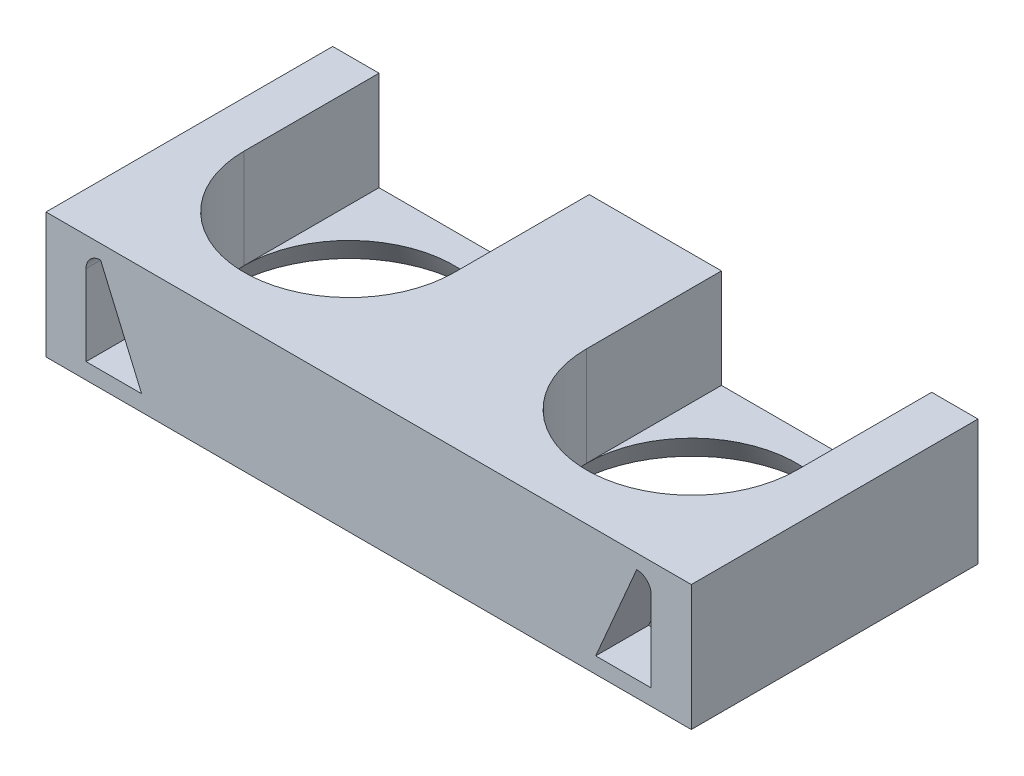
ISO-10303-21;
HEADER;
FILE_DESCRIPTION(('STEP AP214'),'2;1');
FILE_NAME('part.step','',(''),(''),'','','');
FILE_SCHEMA(('AUTOMOTIVE_DESIGN { 1 0 10303 214 1 1 1 1 }'));
ENDSEC;
DATA;
#1=APPLICATION_CONTEXT('core data for automotive mechanical design processes');
#2=APPLICATION_PROTOCOL_DEFINITION('international standard','automotive_design',2000,#1);
#3=PRODUCT_CONTEXT('',#1,'mechanical');
#4=PRODUCT('Part','Part','',(#3));
#5=PRODUCT_RELATED_PRODUCT_CATEGORY('part','',(#4));
#6=PRODUCT_DEFINITION_FORMATION('','',#4);
#7=PRODUCT_DEFINITION_CONTEXT('part definition',#1,'design');
#8=PRODUCT_DEFINITION('design','',#6,#7);
#9=PRODUCT_DEFINITION_SHAPE('','',#8);
#10=(LENGTH_UNIT() NAMED_UNIT(*) SI_UNIT(.MILLI.,.METRE.));
#11=(NAMED_UNIT(*) PLANE_ANGLE_UNIT() SI_UNIT($,.RADIAN.));
#12=(NAMED_UNIT(*) SI_UNIT($,.STERADIAN.) SOLID_ANGLE_UNIT());
#13=UNCERTAINTY_MEASURE_WITH_UNIT(LENGTH_MEASURE(1.E-05),#10,'distance_accuracy_value','');
#14=(GEOMETRIC_REPRESENTATION_CONTEXT(3) GLOBAL_UNCERTAINTY_ASSIGNED_CONTEXT((#13)) GLOBAL_UNIT_ASSIGNED_CONTEXT((#10,
#11,#12)) REPRESENTATION_CONTEXT('',''));
#15=CARTESIAN_POINT('',(0.,0.,0.));
#16=DIRECTION('',(0.,0.,1.));
#17=DIRECTION('',(1.,0.,0.));
#18=AXIS2_PLACEMENT_3D('',#15,#16,#17);
#19=CARTESIAN_POINT('',(24.404047634165,-12.4,1.28478141343808));
#20=DIRECTION('',(0.,0.,-1.));
#21=DIRECTION('',(-1.,0.,0.));
#22=AXIS2_PLACEMENT_3D('',#19,#20,#21);
#23=PLANE('',#22);
#24=DIRECTION('',(-0.39545835021334,0.918483910172924,0.));
#25=VECTOR('',#24,1.);
#26=CARTESIAN_POINT('',(-19.2778693688237,-8.3001937560213,1.28478141343808));
#27=LINE('',#26,#25);
#28=CARTESIAN_POINT('',(-17.1732064728308,-13.1884430628437,1.28478141343808));
#29=VERTEX_POINT('',#28);
#30=CARTESIAN_POINT('',(-20.2732064728308,-5.98844306284365,1.28478141343808));
#31=VERTEX_POINT('',#30);
#32=EDGE_CURVE('E209',#29,#31,#27,.T.);
#33=ORIENTED_EDGE('',*,*,#32,.F.);
#34=DIRECTION('',(1.,0.,0.));
#35=VECTOR('',#34,1.);
#36=CARTESIAN_POINT('',(0.,-13.1884430628437,1.28478141343808));
#37=LINE('',#36,#35);
#38=CARTESIAN_POINT('',(-21.3732064728308,-13.1884430628437,1.28478141343808));
#39=VERTEX_POINT('',#38);
#40=EDGE_CURVE('E78',#39,#29,#37,.T.);
#41=ORIENTED_EDGE('',*,*,#40,.F.);
#42=DIRECTION('',(0.,-1.,0.));
#43=VECTOR('',#42,1.);
#44=CARTESIAN_POINT('',(-21.3732064728308,0.,1.28478141343808));
#45=LINE('',#44,#43);
#46=CARTESIAN_POINT('',(-21.3732064728308,-7.08844306284365,1.28478141343808));
#47=VERTEX_POINT('',#46);
#48=EDGE_CURVE('E227',#47,#39,#45,.T.);
#49=ORIENTED_EDGE('',*,*,#48,.F.);
#50=CARTESIAN_POINT('',(-20.2732064728308,-7.08844306284365,1.28478141343808));
#51=DIRECTION('',(0.,0.,1.));
#52=DIRECTION('',(1.,0.,0.));
#53=AXIS2_PLACEMENT_3D('',#50,#51,#52);
#54=CIRCLE('',#53,1.1);
#55=EDGE_CURVE('E233',#31,#47,#54,.T.);
#56=ORIENTED_EDGE('',*,*,#55,.F.);
#57=EDGE_LOOP('',(#33,#41,#49,#56));
#58=FACE_BOUND('',#57,.T.);
#59=DIRECTION('',(-1.,0.,0.));
#60=VECTOR('',#59,1.);
#61=CARTESIAN_POINT('',(24.404047634165,-4.9,1.28478141343808));
#62=LINE('',#61,#60);
#63=CARTESIAN_POINT('',(24.404047634165,-4.9,1.28478141343808));
#64=VERTEX_POINT('',#63);
#65=CARTESIAN_POINT('',(-24.404047634165,-4.9,1.28478141343808));
#66=VERTEX_POINT('',#65);
#67=EDGE_CURVE('E318',#64,#66,#62,.T.);
#68=ORIENTED_EDGE('',*,*,#67,.T.);
#69=DIRECTION('',(0.,1.,0.));
#70=VECTOR('',#69,1.);
#71=CARTESIAN_POINT('',(-24.404047634165,-12.4,1.28478141343808));
#72=LINE('',#71,#70);
#73=CARTESIAN_POINT('',(-24.404047634165,-14.4,1.28478141343808));
#74=VERTEX_POINT('',#73);
#75=EDGE_CURVE('E353',#74,#66,#72,.T.);
#76=ORIENTED_EDGE('',*,*,#75,.F.);
#77=DIRECTION('',(-1.,0.,0.));
#78=VECTOR('',#77,1.);
#79=CARTESIAN_POINT('',(24.404047634165,-14.4,1.28478141343808));
#80=LINE('',#79,#78);
#81=CARTESIAN_POINT('',(24.404047634165,-14.4,1.28478141343808));
#82=VERTEX_POINT('',#81);
#83=EDGE_CURVE('E278',#82,#74,#80,.T.);
#84=ORIENTED_EDGE('',*,*,#83,.F.);
#85=DIRECTION('',(0.,1.,0.));
#86=VECTOR('',#85,1.);
#87=CARTESIAN_POINT('',(24.404047634165,-12.4,1.28478141343808));
#88=LINE('',#87,#86);
#89=EDGE_CURVE('E356',#82,#64,#88,.T.);
#90=ORIENTED_EDGE('',*,*,#89,.T.);
#91=EDGE_LOOP('',(#68,#76,#84,#90));
#92=FACE_BOUND('',#91,.T.);
#93=CARTESIAN_POINT('',(20.2732064728308,-7.08844306284365,1.28478141343808));
#94=DIRECTION('',(0.,0.,1.));
#95=DIRECTION('',(1.,0.,0.));
#96=AXIS2_PLACEMENT_3D('',#93,#94,#95);
#97=CIRCLE('',#96,1.1);
#98=CARTESIAN_POINT('',(20.2732064728308,-5.98844306284365,1.28478141343808));
#99=VERTEX_POINT('',#98);
#100=CARTESIAN_POINT('',(21.3732064728308,-7.08844306284365,1.28478141343808));
#101=VERTEX_POINT('',#100);
#102=EDGE_CURVE('E86',#99,#101,#97,.F.);
#103=ORIENTED_EDGE('',*,*,#102,.T.);
#104=DIRECTION('',(0.,-1.,0.));
#105=VECTOR('',#104,1.);
#106=CARTESIAN_POINT('',(21.3732064728308,0.,1.28478141343808));
#107=LINE('',#106,#105);
#108=CARTESIAN_POINT('',(21.3732064728308,-13.1884430628437,1.28478141343808));
#109=VERTEX_POINT('',#108);
#110=EDGE_CURVE('E252',#101,#109,#107,.T.);
#111=ORIENTED_EDGE('',*,*,#110,.T.);
#112=DIRECTION('',(-1.,0.,0.));
#113=VECTOR('',#112,1.);
#114=CARTESIAN_POINT('',(0.,-13.1884430628437,1.28478141343808));
#115=LINE('',#114,#113);
#116=CARTESIAN_POINT('',(17.1732064728308,-13.1884430628437,1.28478141343808));
#117=VERTEX_POINT('',#116);
#118=EDGE_CURVE('E255',#109,#117,#115,.T.);
#119=ORIENTED_EDGE('',*,*,#118,.T.);
#120=DIRECTION('',(0.39545835021334,0.918483910172924,0.));
#121=VECTOR('',#120,1.);
#122=CARTESIAN_POINT('',(19.2778693688238,-8.30019375602131,1.28478141343808));
#123=LINE('',#122,#121);
#124=EDGE_CURVE('E259',#117,#99,#123,.T.);
#125=ORIENTED_EDGE('',*,*,#124,.T.);
#126=EDGE_LOOP('',(#103,#111,#119,#125));
#127=FACE_BOUND('',#126,.T.);
#128=ADVANCED_FACE('F62',(#58,#92,#127),#23,.F.);
#129=CARTESIAN_POINT('',(0.,-12.4,0.));
#130=DIRECTION('',(0.,1.,0.));
#131=DIRECTION('',(0.,0.,1.));
#132=AXIS2_PLACEMENT_3D('',#129,#130,#131);
#133=PLANE('',#132);
#134=DIRECTION('',(0.,0.,1.));
#135=VECTOR('',#134,1.);
#136=CARTESIAN_POINT('',(-20.9,-12.4,-10.2));
#137=LINE('',#136,#135);
#138=CARTESIAN_POINT('',(-20.9,-12.4,-20.4));
#139=VERTEX_POINT('',#138);
#140=CARTESIAN_POINT('',(-20.9,-12.4,-10.2));
#141=VERTEX_POINT('',#140);
#142=EDGE_CURVE('E298',#139,#141,#137,.T.);
#143=ORIENTED_EDGE('',*,*,#142,.T.);
#144=CARTESIAN_POINT('',(-12.95,-12.4,-10.2));
#145=DIRECTION('',(0.,-1.,0.));
#146=DIRECTION('',(0.,0.,-1.));
#147=AXIS2_PLACEMENT_3D('',#144,#145,#146);
#148=CIRCLE('',#147,7.94999999999999);
#149=CARTESIAN_POINT('',(-5.,-12.4,-10.2));
#150=VERTEX_POINT('',#149);
#151=EDGE_CURVE('E239',#141,#150,#148,.T.);
#152=ORIENTED_EDGE('',*,*,#151,.T.);
#153=DIRECTION('',(0.,0.,-1.));
#154=VECTOR('',#153,1.);
#155=CARTESIAN_POINT('',(-5.,-12.4,-10.2));
#156=LINE('',#155,#154);
#157=CARTESIAN_POINT('',(-5.,-12.4,-20.4));
#158=VERTEX_POINT('',#157);
#159=EDGE_CURVE('E303',#150,#158,#156,.T.);
#160=ORIENTED_EDGE('',*,*,#159,.T.);
#161=DIRECTION('',(1.,0.,0.));
#162=VECTOR('',#161,1.);
#163=CARTESIAN_POINT('',(24.404047634165,-12.4,-20.4));
#164=LINE('',#163,#162);
#165=EDGE_CURVE('E279',#139,#158,#164,.T.);
#166=ORIENTED_EDGE('',*,*,#165,.F.);
#167=EDGE_LOOP('',(#143,#152,#160,#166));
#168=FACE_BOUND('',#167,.T.);
#169=ADVANCED_FACE('F409',(#168),#133,.T.);
#170=DIRECTION('',(0.,0.,1.));
#171=VECTOR('',#170,1.);
#172=CARTESIAN_POINT('',(5.00000000000001,-12.4,-10.2));
#173=LINE('',#172,#171);
#174=CARTESIAN_POINT('',(5.00000000000001,-12.4,-20.4));
#175=VERTEX_POINT('',#174);
#176=CARTESIAN_POINT('',(5.00000000000001,-12.4,-10.2));
#177=VERTEX_POINT('',#176);
#178=EDGE_CURVE('E306',#175,#177,#173,.T.);
#179=ORIENTED_EDGE('',*,*,#178,.T.);
#180=CARTESIAN_POINT('',(12.95,-12.4,-10.2));
#181=DIRECTION('',(0.,1.,0.));
#182=DIRECTION('',(0.,0.,1.));
#183=AXIS2_PLACEMENT_3D('',#180,#181,#182);
#184=CIRCLE('',#183,7.95);
#185=CARTESIAN_POINT('',(20.9,-12.4,-10.2));
#186=VERTEX_POINT('',#185);
#187=EDGE_CURVE('E12',#177,#186,#184,.F.);
#188=ORIENTED_EDGE('',*,*,#187,.T.);
#189=DIRECTION('',(0.,0.,-1.));
#190=VECTOR('',#189,1.);
#191=CARTESIAN_POINT('',(20.9,-12.4,-10.2));
#192=LINE('',#191,#190);
#193=CARTESIAN_POINT('',(20.9,-12.4,-20.4));
#194=VERTEX_POINT('',#193);
#195=EDGE_CURVE('E294',#186,#194,#192,.T.);
#196=ORIENTED_EDGE('',*,*,#195,.T.);
#197=EDGE_CURVE('E289',#175,#194,#164,.T.);
#198=ORIENTED_EDGE('',*,*,#197,.F.);
#199=EDGE_LOOP('',(#179,#188,#196,#198));
#200=FACE_BOUND('',#199,.T.);
#201=ADVANCED_FACE('F428',(#200),#133,.T.);
#202=CARTESIAN_POINT('',(12.95,-12.4,-10.2));
#203=DIRECTION('',(0.,1.,0.));
#204=DIRECTION('',(0.,0.,1.));
#205=AXIS2_PLACEMENT_3D('',#202,#203,#204);
#206=CYLINDRICAL_SURFACE('',#205,7.95);
#207=CARTESIAN_POINT('',(12.95,-4.9,-10.2));
#208=DIRECTION('',(0.,1.,0.));
#209=DIRECTION('',(0.,0.,-1.));
#210=AXIS2_PLACEMENT_3D('',#207,#208,#209);
#211=CIRCLE('',#210,7.95);
#212=CARTESIAN_POINT('',(5.00000000000001,-4.9,-10.2));
#213=VERTEX_POINT('',#212);
#214=CARTESIAN_POINT('',(20.9,-4.9,-10.2));
#215=VERTEX_POINT('',#214);
#216=EDGE_CURVE('E288',#213,#215,#211,.T.);
#217=ORIENTED_EDGE('',*,*,#216,.T.);
#218=DIRECTION('',(0.,1.,0.));
#219=VECTOR('',#218,1.);
#220=CARTESIAN_POINT('',(20.9,-12.4,-10.2));
#221=LINE('',#220,#219);
#222=EDGE_CURVE('E71',#186,#215,#221,.T.);
#223=ORIENTED_EDGE('',*,*,#222,.F.);
#224=CARTESIAN_POINT('',(12.95,-12.4,-10.2));
#225=DIRECTION('',(0.,1.,0.));
#226=DIRECTION('',(0.,0.,-1.));
#227=AXIS2_PLACEMENT_3D('',#224,#225,#226);
#228=CIRCLE('',#227,7.95);
#229=EDGE_CURVE('E292',#177,#186,#228,.T.);
#230=ORIENTED_EDGE('',*,*,#229,.F.);
#231=DIRECTION('',(0.,1.,0.));
#232=VECTOR('',#231,1.);
#233=CARTESIAN_POINT('',(5.00000000000001,-12.4,-10.2));
#234=LINE('',#233,#232);
#235=EDGE_CURVE('E309',#177,#213,#234,.T.);
#236=ORIENTED_EDGE('',*,*,#235,.T.);
#237=EDGE_LOOP('',(#217,#223,#230,#236));
#238=FACE_BOUND('',#237,.T.);
#239=ADVANCED_FACE('F64',(#238),#206,.F.);
#240=CARTESIAN_POINT('',(20.9,-12.4,-10.2));
#241=DIRECTION('',(1.,0.,0.));
#242=DIRECTION('',(0.,0.,-1.));
#243=AXIS2_PLACEMENT_3D('',#240,#241,#242);
#244=PLANE('',#243);
#245=DIRECTION('',(0.,0.,-1.));
#246=VECTOR('',#245,1.);
#247=CARTESIAN_POINT('',(20.9,-4.9,-10.2));
#248=LINE('',#247,#246);
#249=CARTESIAN_POINT('',(20.9,-4.9,-20.4));
#250=VERTEX_POINT('',#249);
#251=EDGE_CURVE('E312',#215,#250,#248,.T.);
#252=ORIENTED_EDGE('',*,*,#251,.T.);
#253=DIRECTION('',(0.,1.,0.));
#254=VECTOR('',#253,1.);
#255=CARTESIAN_POINT('',(20.9,-12.4,-20.4));
#256=LINE('',#255,#254);
#257=EDGE_CURVE('E362',#194,#250,#256,.T.);
#258=ORIENTED_EDGE('',*,*,#257,.F.);
#259=ORIENTED_EDGE('',*,*,#195,.F.);
#260=ORIENTED_EDGE('',*,*,#222,.T.);
#261=EDGE_LOOP('',(#252,#258,#259,#260));
#262=FACE_BOUND('',#261,.T.);
#263=ADVANCED_FACE('F369',(#262),#244,.F.);
#264=CARTESIAN_POINT('',(24.404047634165,-12.4,-20.4));
#265=DIRECTION('',(-1.,0.,0.));
#266=DIRECTION('',(0.,0.,1.));
#267=AXIS2_PLACEMENT_3D('',#264,#265,#266);
#268=PLANE('',#267);
#269=DIRECTION('',(0.,0.,1.));
#270=VECTOR('',#269,1.);
#271=CARTESIAN_POINT('',(24.404047634165,-4.9,-20.4));
#272=LINE('',#271,#270);
#273=CARTESIAN_POINT('',(24.404047634165,-4.9,-20.4));
#274=VERTEX_POINT('',#273);
#275=EDGE_CURVE('E316',#274,#64,#272,.T.);
#276=ORIENTED_EDGE('',*,*,#275,.T.);
#277=ORIENTED_EDGE('',*,*,#89,.F.);
#278=DIRECTION('',(0.,0.,1.));
#279=VECTOR('',#278,1.);
#280=CARTESIAN_POINT('',(24.404047634165,-14.4,1.28478141343808));
#281=LINE('',#280,#279);
#282=CARTESIAN_POINT('',(24.404047634165,-14.4,-20.4));
#283=VERTEX_POINT('',#282);
#284=EDGE_CURVE('E275',#283,#82,#281,.T.);
#285=ORIENTED_EDGE('',*,*,#284,.F.);
#286=DIRECTION('',(0.,1.,0.));
#287=VECTOR('',#286,1.);
#288=CARTESIAN_POINT('',(24.404047634165,-12.4,-20.4));
#289=LINE('',#288,#287);
#290=EDGE_CURVE('E359',#283,#274,#289,.T.);
#291=ORIENTED_EDGE('',*,*,#290,.T.);
#292=EDGE_LOOP('',(#276,#277,#285,#291));
#293=FACE_BOUND('',#292,.T.);
#294=ADVANCED_FACE('F386',(#293),#268,.F.);
#295=CARTESIAN_POINT('',(-24.404047634165,-12.4,-20.4));
#296=DIRECTION('',(1.,0.,0.));
#297=DIRECTION('',(0.,0.,-1.));
#298=AXIS2_PLACEMENT_3D('',#295,#296,#297);
#299=PLANE('',#298);
#300=DIRECTION('',(0.,0.,-1.));
#301=VECTOR('',#300,1.);
#302=CARTESIAN_POINT('',(-24.404047634165,-4.9,-20.4));
#303=LINE('',#302,#301);
#304=CARTESIAN_POINT('',(-24.404047634165,-4.9,-20.4));
#305=VERTEX_POINT('',#304);
#306=EDGE_CURVE('E320',#66,#305,#303,.T.);
#307=ORIENTED_EDGE('',*,*,#306,.T.);
#308=DIRECTION('',(0.,1.,0.));
#309=VECTOR('',#308,1.);
#310=CARTESIAN_POINT('',(-24.404047634165,-12.4,-20.4));
#311=LINE('',#310,#309);
#312=CARTESIAN_POINT('',(-24.404047634165,-14.4,-20.4));
#313=VERTEX_POINT('',#312);
#314=EDGE_CURVE('E350',#313,#305,#311,.T.);
#315=ORIENTED_EDGE('',*,*,#314,.F.);
#316=DIRECTION('',(0.,0.,-1.));
#317=VECTOR('',#316,1.);
#318=CARTESIAN_POINT('',(-24.404047634165,-14.4,1.28478141343808));
#319=LINE('',#318,#317);
#320=EDGE_CURVE('E282',#74,#313,#319,.T.);
#321=ORIENTED_EDGE('',*,*,#320,.F.);
#322=ORIENTED_EDGE('',*,*,#75,.T.);
#323=EDGE_LOOP('',(#307,#315,#321,#322));
#324=FACE_BOUND('',#323,.T.);
#325=ADVANCED_FACE('F433',(#324),#299,.F.);
#326=CARTESIAN_POINT('',(-20.9,-12.4,-10.2));
#327=DIRECTION('',(-1.,0.,0.));
#328=DIRECTION('',(0.,0.,1.));
#329=AXIS2_PLACEMENT_3D('',#326,#327,#328);
#330=PLANE('',#329);
#331=DIRECTION('',(0.,0.,1.));
#332=VECTOR('',#331,1.);
#333=CARTESIAN_POINT('',(-20.9,-4.9,-10.2));
#334=LINE('',#333,#332);
#335=CARTESIAN_POINT('',(-20.9,-4.9,-20.4));
#336=VERTEX_POINT('',#335);
#337=CARTESIAN_POINT('',(-20.9,-4.9,-10.2));
#338=VERTEX_POINT('',#337);
#339=EDGE_CURVE('E324',#336,#338,#334,.T.);
#340=ORIENTED_EDGE('',*,*,#339,.T.);
#341=DIRECTION('',(0.,1.,0.));
#342=VECTOR('',#341,1.);
#343=CARTESIAN_POINT('',(-20.9,-12.4,-10.2));
#344=LINE('',#343,#342);
#345=EDGE_CURVE('E344',#141,#338,#344,.T.);
#346=ORIENTED_EDGE('',*,*,#345,.F.);
#347=ORIENTED_EDGE('',*,*,#142,.F.);
#348=DIRECTION('',(0.,1.,0.));
#349=VECTOR('',#348,1.);
#350=CARTESIAN_POINT('',(-20.9,-12.4,-20.4));
#351=LINE('',#350,#349);
#352=EDGE_CURVE('E347',#139,#336,#351,.T.);
#353=ORIENTED_EDGE('',*,*,#352,.T.);
#354=EDGE_LOOP('',(#340,#346,#347,#353));
#355=FACE_BOUND('',#354,.T.);
#356=ADVANCED_FACE('F399',(#355),#330,.F.);
#357=CARTESIAN_POINT('',(-12.95,-12.4,-10.2));
#358=DIRECTION('',(0.,1.,0.));
#359=DIRECTION('',(0.,0.,1.));
#360=AXIS2_PLACEMENT_3D('',#357,#358,#359);
#361=CYLINDRICAL_SURFACE('',#360,7.94999999999999);
#362=CARTESIAN_POINT('',(-12.95,-4.9,-10.2));
#363=DIRECTION('',(0.,1.,0.));
#364=DIRECTION('',(0.,0.,-1.));
#365=AXIS2_PLACEMENT_3D('',#362,#363,#364);
#366=CIRCLE('',#365,7.94999999999999);
#367=CARTESIAN_POINT('',(-5.,-4.9,-10.2));
#368=VERTEX_POINT('',#367);
#369=EDGE_CURVE('E326',#338,#368,#366,.T.);
#370=ORIENTED_EDGE('',*,*,#369,.T.);
#371=DIRECTION('',(0.,1.,0.));
#372=VECTOR('',#371,1.);
#373=CARTESIAN_POINT('',(-5.,-12.4,-10.2));
#374=LINE('',#373,#372);
#375=EDGE_CURVE('E341',#150,#368,#374,.T.);
#376=ORIENTED_EDGE('',*,*,#375,.F.);
#377=CARTESIAN_POINT('',(-12.95,-12.4,-10.2));
#378=DIRECTION('',(0.,1.,0.));
#379=DIRECTION('',(0.,0.,-1.));
#380=AXIS2_PLACEMENT_3D('',#377,#378,#379);
#381=CIRCLE('',#380,7.94999999999999);
#382=EDGE_CURVE('E301',#141,#150,#381,.T.);
#383=ORIENTED_EDGE('',*,*,#382,.F.);
#384=ORIENTED_EDGE('',*,*,#345,.T.);
#385=EDGE_LOOP('',(#370,#376,#383,#384));
#386=FACE_BOUND('',#385,.T.);
#387=ADVANCED_FACE('F403',(#386),#361,.F.);
#388=CARTESIAN_POINT('',(-5.,-12.4,-10.2));
#389=DIRECTION('',(1.,0.,0.));
#390=DIRECTION('',(0.,0.,-1.));
#391=AXIS2_PLACEMENT_3D('',#388,#389,#390);
#392=PLANE('',#391);
#393=DIRECTION('',(0.,0.,-1.));
#394=VECTOR('',#393,1.);
#395=CARTESIAN_POINT('',(-5.,-4.9,-10.2));
#396=LINE('',#395,#394);
#397=CARTESIAN_POINT('',(-5.,-4.9,-20.4));
#398=VERTEX_POINT('',#397);
#399=EDGE_CURVE('E328',#368,#398,#396,.T.);
#400=ORIENTED_EDGE('',*,*,#399,.T.);
#401=DIRECTION('',(0.,1.,0.));
#402=VECTOR('',#401,1.);
#403=CARTESIAN_POINT('',(-5.,-12.4,-20.4));
#404=LINE('',#403,#402);
#405=EDGE_CURVE('E338',#158,#398,#404,.T.);
#406=ORIENTED_EDGE('',*,*,#405,.F.);
#407=ORIENTED_EDGE('',*,*,#159,.F.);
#408=ORIENTED_EDGE('',*,*,#375,.T.);
#409=EDGE_LOOP('',(#400,#406,#407,#408));
#410=FACE_BOUND('',#409,.T.);
#411=ADVANCED_FACE('F412',(#410),#392,.F.);
#412=CARTESIAN_POINT('',(5.00000000000001,-12.4,-20.4));
#413=DIRECTION('',(0.,0.,1.));
#414=DIRECTION('',(1.,0.,0.));
#415=AXIS2_PLACEMENT_3D('',#412,#413,#414);
#416=PLANE('',#415);
#417=DIRECTION('',(1.,0.,0.));
#418=VECTOR('',#417,1.);
#419=CARTESIAN_POINT('',(5.00000000000001,-4.9,-20.4));
#420=LINE('',#419,#418);
#421=CARTESIAN_POINT('',(5.00000000000001,-4.9,-20.4));
#422=VERTEX_POINT('',#421);
#423=EDGE_CURVE('E330',#398,#422,#420,.T.);
#424=ORIENTED_EDGE('',*,*,#423,.T.);
#425=DIRECTION('',(0.,1.,0.));
#426=VECTOR('',#425,1.);
#427=CARTESIAN_POINT('',(5.00000000000001,-12.4,-20.4));
#428=LINE('',#427,#426);
#429=EDGE_CURVE('E335',#175,#422,#428,.T.);
#430=ORIENTED_EDGE('',*,*,#429,.F.);
#431=ORIENTED_EDGE('',*,*,#197,.T.);
#432=ORIENTED_EDGE('',*,*,#257,.T.);
#433=DIRECTION('',(1.,0.,0.));
#434=VECTOR('',#433,1.);
#435=CARTESIAN_POINT('',(20.9,-4.9,-20.4));
#436=LINE('',#435,#434);
#437=EDGE_CURVE('E314',#250,#274,#436,.T.);
#438=ORIENTED_EDGE('',*,*,#437,.T.);
#439=ORIENTED_EDGE('',*,*,#290,.F.);
#440=DIRECTION('',(1.,0.,0.));
#441=VECTOR('',#440,1.);
#442=CARTESIAN_POINT('',(24.404047634165,-14.4,-20.4));
#443=LINE('',#442,#441);
#444=EDGE_CURVE('E285',#313,#283,#443,.T.);
#445=ORIENTED_EDGE('',*,*,#444,.F.);
#446=ORIENTED_EDGE('',*,*,#314,.T.);
#447=DIRECTION('',(1.,0.,0.));
#448=VECTOR('',#447,1.);
#449=CARTESIAN_POINT('',(-24.404047634165,-4.9,-20.4));
#450=LINE('',#449,#448);
#451=EDGE_CURVE('E322',#305,#336,#450,.T.);
#452=ORIENTED_EDGE('',*,*,#451,.T.);
#453=ORIENTED_EDGE('',*,*,#352,.F.);
#454=ORIENTED_EDGE('',*,*,#165,.T.);
#455=ORIENTED_EDGE('',*,*,#405,.T.);
#456=EDGE_LOOP('',(#424,#430,#431,#432,#438,#439,#445,#446,#452,#453,#454,#455));
#457=FACE_BOUND('',#456,.T.);
#458=ADVANCED_FACE('F382',(#457),#416,.F.);
#459=CARTESIAN_POINT('',(5.00000000000001,-12.4,-10.2));
#460=DIRECTION('',(-1.,0.,0.));
#461=DIRECTION('',(0.,0.,1.));
#462=AXIS2_PLACEMENT_3D('',#459,#460,#461);
#463=PLANE('',#462);
#464=DIRECTION('',(0.,0.,1.));
#465=VECTOR('',#464,1.);
#466=CARTESIAN_POINT('',(5.00000000000001,-4.9,-10.2));
#467=LINE('',#466,#465);
#468=EDGE_CURVE('E295',#422,#213,#467,.T.);
#469=ORIENTED_EDGE('',*,*,#468,.T.);
#470=ORIENTED_EDGE('',*,*,#235,.F.);
#471=ORIENTED_EDGE('',*,*,#178,.F.);
#472=ORIENTED_EDGE('',*,*,#429,.T.);
#473=EDGE_LOOP('',(#469,#470,#471,#472));
#474=FACE_BOUND('',#473,.T.);
#475=ADVANCED_FACE('F419',(#474),#463,.F.);
#476=CARTESIAN_POINT('',(12.95,-4.9,-10.2));
#477=DIRECTION('',(0.,-1.,0.));
#478=DIRECTION('',(0.,0.,-1.));
#479=AXIS2_PLACEMENT_3D('',#476,#477,#478);
#480=PLANE('',#479);
#481=ORIENTED_EDGE('',*,*,#216,.F.);
#482=ORIENTED_EDGE('',*,*,#468,.F.);
#483=ORIENTED_EDGE('',*,*,#423,.F.);
#484=ORIENTED_EDGE('',*,*,#399,.F.);
#485=ORIENTED_EDGE('',*,*,#369,.F.);
#486=ORIENTED_EDGE('',*,*,#339,.F.);
#487=ORIENTED_EDGE('',*,*,#451,.F.);
#488=ORIENTED_EDGE('',*,*,#306,.F.);
#489=ORIENTED_EDGE('',*,*,#67,.F.);
#490=ORIENTED_EDGE('',*,*,#275,.F.);
#491=ORIENTED_EDGE('',*,*,#437,.F.);
#492=ORIENTED_EDGE('',*,*,#251,.F.);
#493=EDGE_LOOP('',(#481,#482,#483,#484,#485,#486,#487,#488,#489,#490,#491,#492));
#494=FACE_BOUND('',#493,.T.);
#495=ADVANCED_FACE('F376',(#494),#480,.F.);
#496=CARTESIAN_POINT('',(0.,-14.4,0.));
#497=DIRECTION('',(0.,1.,0.));
#498=DIRECTION('',(0.,0.,1.));
#499=AXIS2_PLACEMENT_3D('',#496,#497,#498);
#500=PLANE('',#499);
#501=CARTESIAN_POINT('',(-12.95,-14.4,-10.2));
#502=DIRECTION('',(0.,1.,0.));
#503=DIRECTION('',(0.,0.,1.));
#504=AXIS2_PLACEMENT_3D('',#501,#502,#503);
#505=CIRCLE('',#504,9.10470053837925);
#506=CARTESIAN_POINT('',(-12.95,-14.4,-1.09529946162075));
#507=VERTEX_POINT('',#506);
#508=EDGE_CURVE('E66',#507,#507,#505,.F.);
#509=ORIENTED_EDGE('',*,*,#508,.F.);
#510=EDGE_LOOP('',(#509));
#511=FACE_BOUND('',#510,.T.);
#512=CARTESIAN_POINT('',(12.95,-14.4,-10.2));
#513=DIRECTION('',(0.,1.,0.));
#514=DIRECTION('',(0.,0.,1.));
#515=AXIS2_PLACEMENT_3D('',#512,#513,#514);
#516=CIRCLE('',#515,9.10470053837925);
#517=CARTESIAN_POINT('',(12.95,-14.4,-1.09529946162075));
#518=VERTEX_POINT('',#517);
#519=EDGE_CURVE('E272',#518,#518,#516,.F.);
#520=ORIENTED_EDGE('',*,*,#519,.F.);
#521=EDGE_LOOP('',(#520));
#522=FACE_BOUND('',#521,.T.);
#523=ORIENTED_EDGE('',*,*,#284,.T.);
#524=ORIENTED_EDGE('',*,*,#83,.T.);
#525=ORIENTED_EDGE('',*,*,#320,.T.);
#526=ORIENTED_EDGE('',*,*,#444,.T.);
#527=EDGE_LOOP('',(#523,#524,#525,#526));
#528=FACE_BOUND('',#527,.T.);
#529=ADVANCED_FACE('F389',(#511,#522,#528),#500,.F.);
#530=CARTESIAN_POINT('',(12.95,-12.4,-10.2));
#531=DIRECTION('',(0.,-1.,0.));
#532=DIRECTION('',(0.,0.,-1.));
#533=AXIS2_PLACEMENT_3D('',#530,#531,#532);
#534=CONICAL_SURFACE('',#533,7.95,0.523598775598299);
#535=ORIENTED_EDGE('',*,*,#229,.T.);
#536=ORIENTED_EDGE('',*,*,#187,.F.);
#537=EDGE_LOOP('',(#535,#536));
#538=FACE_BOUND('',#537,.T.);
#539=ORIENTED_EDGE('',*,*,#519,.T.);
#540=EDGE_LOOP('',(#539));
#541=FACE_BOUND('',#540,.T.);
#542=ADVANCED_FACE('F458',(#538,#541),#534,.F.);
#543=CARTESIAN_POINT('',(-12.95,-12.4,-10.2));
#544=DIRECTION('',(0.,-1.,0.));
#545=DIRECTION('',(0.,0.,-1.));
#546=AXIS2_PLACEMENT_3D('',#543,#544,#545);
#547=CONICAL_SURFACE('',#546,7.94999999999999,0.523598775598299);
#548=ORIENTED_EDGE('',*,*,#382,.T.);
#549=ORIENTED_EDGE('',*,*,#151,.F.);
#550=EDGE_LOOP('',(#548,#549));
#551=FACE_BOUND('',#550,.T.);
#552=ORIENTED_EDGE('',*,*,#508,.T.);
#553=EDGE_LOOP('',(#552));
#554=FACE_BOUND('',#553,.T.);
#555=ADVANCED_FACE('F461',(#551,#554),#547,.F.);
#556=CARTESIAN_POINT('',(20.2732064728308,-7.08844306284365,-2.71521858656192));
#557=DIRECTION('',(0.,0.,1.));
#558=DIRECTION('',(1.,0.,0.));
#559=AXIS2_PLACEMENT_3D('',#556,#557,#558);
#560=CYLINDRICAL_SURFACE('',#559,1.1);
#561=ORIENTED_EDGE('',*,*,#102,.F.);
#562=DIRECTION('',(0.,0.,1.));
#563=VECTOR('',#562,1.);
#564=CARTESIAN_POINT('',(20.2732064728308,-5.98844306284365,-2.71521858656192));
#565=LINE('',#564,#563);
#566=CARTESIAN_POINT('',(20.2732064728308,-5.98844306284365,-2.71521858656192));
#567=VERTEX_POINT('',#566);
#568=EDGE_CURVE('E243',#567,#99,#565,.T.);
#569=ORIENTED_EDGE('',*,*,#568,.F.);
#570=CARTESIAN_POINT('',(20.2732064728308,-7.08844306284365,-2.71521858656192));
#571=DIRECTION('',(0.,0.,1.));
#572=DIRECTION('',(1.,0.,0.));
#573=AXIS2_PLACEMENT_3D('',#570,#571,#572);
#574=CIRCLE('',#573,1.1);
#575=CARTESIAN_POINT('',(21.3732064728308,-7.08844306284365,-2.71521858656192));
#576=VERTEX_POINT('',#575);
#577=EDGE_CURVE('E256',#567,#576,#574,.F.);
#578=ORIENTED_EDGE('',*,*,#577,.T.);
#579=DIRECTION('',(0.,0.,1.));
#580=VECTOR('',#579,1.);
#581=CARTESIAN_POINT('',(21.3732064728308,-7.08844306284365,-2.71521858656192));
#582=LINE('',#581,#580);
#583=EDGE_CURVE('E250',#576,#101,#582,.T.);
#584=ORIENTED_EDGE('',*,*,#583,.T.);
#585=EDGE_LOOP('',(#561,#569,#578,#584));
#586=FACE_BOUND('',#585,.T.);
#587=ADVANCED_FACE('F472',(#586),#560,.F.);
#588=CARTESIAN_POINT('',(21.3732064728308,0.,-2.71521858656192));
#589=DIRECTION('',(-1.,0.,0.));
#590=DIRECTION('',(0.,0.,1.));
#591=AXIS2_PLACEMENT_3D('',#588,#589,#590);
#592=PLANE('',#591);
#593=ORIENTED_EDGE('',*,*,#110,.F.);
#594=ORIENTED_EDGE('',*,*,#583,.F.);
#595=DIRECTION('',(0.,-1.,0.));
#596=VECTOR('',#595,1.);
#597=CARTESIAN_POINT('',(21.3732064728308,0.,-2.71521858656192));
#598=LINE('',#597,#596);
#599=CARTESIAN_POINT('',(21.3732064728308,-13.1884430628437,-2.71521858656192));
#600=VERTEX_POINT('',#599);
#601=EDGE_CURVE('E245',#576,#600,#598,.T.);
#602=ORIENTED_EDGE('',*,*,#601,.T.);
#603=DIRECTION('',(0.,0.,1.));
#604=VECTOR('',#603,1.);
#605=CARTESIAN_POINT('',(21.3732064728308,-13.1884430628437,-2.71521858656192));
#606=LINE('',#605,#604);
#607=EDGE_CURVE('E248',#600,#109,#606,.T.);
#608=ORIENTED_EDGE('',*,*,#607,.T.);
#609=EDGE_LOOP('',(#593,#594,#602,#608));
#610=FACE_BOUND('',#609,.T.);
#611=ADVANCED_FACE('F477',(#610),#592,.T.);
#612=CARTESIAN_POINT('',(0.,-13.1884430628437,-2.71521858656192));
#613=DIRECTION('',(0.,1.,0.));
#614=DIRECTION('',(0.,0.,1.));
#615=AXIS2_PLACEMENT_3D('',#612,#613,#614);
#616=PLANE('',#615);
#617=ORIENTED_EDGE('',*,*,#118,.F.);
#618=ORIENTED_EDGE('',*,*,#607,.F.);
#619=DIRECTION('',(-1.,0.,0.));
#620=VECTOR('',#619,1.);
#621=CARTESIAN_POINT('',(0.,-13.1884430628437,-2.71521858656192));
#622=LINE('',#621,#620);
#623=CARTESIAN_POINT('',(17.1732064728308,-13.1884430628437,-2.71521858656192));
#624=VERTEX_POINT('',#623);
#625=EDGE_CURVE('E264',#600,#624,#622,.T.);
#626=ORIENTED_EDGE('',*,*,#625,.T.);
#627=DIRECTION('',(0.,0.,1.));
#628=VECTOR('',#627,1.);
#629=CARTESIAN_POINT('',(17.1732064728308,-13.1884430628437,-2.71521858656192));
#630=LINE('',#629,#628);
#631=EDGE_CURVE('E246',#624,#117,#630,.T.);
#632=ORIENTED_EDGE('',*,*,#631,.T.);
#633=EDGE_LOOP('',(#617,#618,#626,#632));
#634=FACE_BOUND('',#633,.T.);
#635=ADVANCED_FACE('F488',(#634),#616,.T.);
#636=CARTESIAN_POINT('',(19.2778693688238,-8.30019375602131,-2.71521858656192));
#637=DIRECTION('',(0.918483910172924,-0.39545835021334,0.));
#638=DIRECTION('',(0.39545835021334,0.918483910172924,0.));
#639=AXIS2_PLACEMENT_3D('',#636,#637,#638);
#640=PLANE('',#639);
#641=ORIENTED_EDGE('',*,*,#124,.F.);
#642=ORIENTED_EDGE('',*,*,#631,.F.);
#643=DIRECTION('',(0.39545835021334,0.918483910172924,0.));
#644=VECTOR('',#643,1.);
#645=CARTESIAN_POINT('',(19.2778693688238,-8.30019375602131,-2.71521858656192));
#646=LINE('',#645,#644);
#647=EDGE_CURVE('E266',#624,#567,#646,.T.);
#648=ORIENTED_EDGE('',*,*,#647,.T.);
#649=ORIENTED_EDGE('',*,*,#568,.T.);
#650=EDGE_LOOP('',(#641,#642,#648,#649));
#651=FACE_BOUND('',#650,.T.);
#652=ADVANCED_FACE('F484',(#651),#640,.T.);
#653=CARTESIAN_POINT('',(0.,0.,-2.71521858656192));
#654=DIRECTION('',(0.,0.,1.));
#655=DIRECTION('',(1.,0.,0.));
#656=AXIS2_PLACEMENT_3D('',#653,#654,#655);
#657=PLANE('',#656);
#658=ORIENTED_EDGE('',*,*,#577,.F.);
#659=ORIENTED_EDGE('',*,*,#647,.F.);
#660=ORIENTED_EDGE('',*,*,#625,.F.);
#661=ORIENTED_EDGE('',*,*,#601,.F.);
#662=EDGE_LOOP('',(#658,#659,#660,#661));
#663=FACE_BOUND('',#662,.T.);
#664=ADVANCED_FACE('F480',(#663),#657,.T.);
#665=CARTESIAN_POINT('',(0.,-13.1884430628437,-2.71521858656192));
#666=DIRECTION('',(0.,-1.,0.));
#667=DIRECTION('',(0.,0.,-1.));
#668=AXIS2_PLACEMENT_3D('',#665,#666,#667);
#669=PLANE('',#668);
#670=ORIENTED_EDGE('',*,*,#40,.T.);
#671=DIRECTION('',(0.,0.,1.));
#672=VECTOR('',#671,1.);
#673=CARTESIAN_POINT('',(-17.1732064728308,-13.1884430628437,-2.71521858656192));
#674=LINE('',#673,#672);
#675=CARTESIAN_POINT('',(-17.1732064728308,-13.1884430628437,-2.71521858656192));
#676=VERTEX_POINT('',#675);
#677=EDGE_CURVE('E237',#676,#29,#674,.T.);
#678=ORIENTED_EDGE('',*,*,#677,.F.);
#679=DIRECTION('',(1.,0.,0.));
#680=VECTOR('',#679,1.);
#681=CARTESIAN_POINT('',(0.,-13.1884430628437,-2.71521858656192));
#682=LINE('',#681,#680);
#683=CARTESIAN_POINT('',(-21.3732064728308,-13.1884430628437,-2.71521858656192));
#684=VERTEX_POINT('',#683);
#685=EDGE_CURVE('E214',#684,#676,#682,.T.);
#686=ORIENTED_EDGE('',*,*,#685,.F.);
#687=DIRECTION('',(0.,0.,1.));
#688=VECTOR('',#687,1.);
#689=CARTESIAN_POINT('',(-21.3732064728308,-13.1884430628437,-2.71521858656192));
#690=LINE('',#689,#688);
#691=EDGE_CURVE('E240',#684,#39,#690,.T.);
#692=ORIENTED_EDGE('',*,*,#691,.T.);
#693=EDGE_LOOP('',(#670,#678,#686,#692));
#694=FACE_BOUND('',#693,.T.);
#695=ADVANCED_FACE('F483',(#694),#669,.F.);
#696=CARTESIAN_POINT('',(-21.3732064728308,0.,-2.71521858656192));
#697=DIRECTION('',(-1.,0.,0.));
#698=DIRECTION('',(0.,0.,1.));
#699=AXIS2_PLACEMENT_3D('',#696,#697,#698);
#700=PLANE('',#699);
#701=ORIENTED_EDGE('',*,*,#48,.T.);
#702=ORIENTED_EDGE('',*,*,#691,.F.);
#703=DIRECTION('',(0.,-1.,0.));
#704=VECTOR('',#703,1.);
#705=CARTESIAN_POINT('',(-21.3732064728308,0.,-2.71521858656192));
#706=LINE('',#705,#704);
#707=CARTESIAN_POINT('',(-21.3732064728308,-7.08844306284365,-2.71521858656192));
#708=VERTEX_POINT('',#707);
#709=EDGE_CURVE('E222',#708,#684,#706,.T.);
#710=ORIENTED_EDGE('',*,*,#709,.F.);
#711=DIRECTION('',(0.,0.,1.));
#712=VECTOR('',#711,1.);
#713=CARTESIAN_POINT('',(-21.3732064728308,-7.08844306284365,-2.71521858656192));
#714=LINE('',#713,#712);
#715=EDGE_CURVE('E213',#708,#47,#714,.T.);
#716=ORIENTED_EDGE('',*,*,#715,.T.);
#717=EDGE_LOOP('',(#701,#702,#710,#716));
#718=FACE_BOUND('',#717,.T.);
#719=ADVANCED_FACE('F500',(#718),#700,.F.);
#720=CARTESIAN_POINT('',(-20.2732064728308,-7.08844306284365,-2.71521858656192));
#721=DIRECTION('',(0.,0.,1.));
#722=DIRECTION('',(1.,0.,0.));
#723=AXIS2_PLACEMENT_3D('',#720,#721,#722);
#724=CYLINDRICAL_SURFACE('',#723,1.1);
#725=ORIENTED_EDGE('',*,*,#55,.T.);
#726=ORIENTED_EDGE('',*,*,#715,.F.);
#727=CARTESIAN_POINT('',(-20.2732064728308,-7.08844306284365,-2.71521858656192));
#728=DIRECTION('',(0.,0.,1.));
#729=DIRECTION('',(1.,0.,0.));
#730=AXIS2_PLACEMENT_3D('',#727,#728,#729);
#731=CIRCLE('',#730,1.1);
#732=CARTESIAN_POINT('',(-20.2732064728308,-5.98844306284365,-2.71521858656192));
#733=VERTEX_POINT('',#732);
#734=EDGE_CURVE('E217',#733,#708,#731,.T.);
#735=ORIENTED_EDGE('',*,*,#734,.F.);
#736=DIRECTION('',(0.,0.,1.));
#737=VECTOR('',#736,1.);
#738=CARTESIAN_POINT('',(-20.2732064728308,-5.98844306284365,-2.71521858656192));
#739=LINE('',#738,#737);
#740=EDGE_CURVE('E202',#733,#31,#739,.T.);
#741=ORIENTED_EDGE('',*,*,#740,.T.);
#742=EDGE_LOOP('',(#725,#726,#735,#741));
#743=FACE_BOUND('',#742,.T.);
#744=ADVANCED_FACE('F218',(#743),#724,.F.);
#745=CARTESIAN_POINT('',(-19.2778693688237,-8.3001937560213,-2.71521858656192));
#746=DIRECTION('',(0.918483910172924,0.39545835021334,0.));
#747=DIRECTION('',(-0.39545835021334,0.918483910172924,0.));
#748=AXIS2_PLACEMENT_3D('',#745,#746,#747);
#749=PLANE('',#748);
#750=ORIENTED_EDGE('',*,*,#32,.T.);
#751=ORIENTED_EDGE('',*,*,#740,.F.);
#752=DIRECTION('',(-0.39545835021334,0.918483910172924,0.));
#753=VECTOR('',#752,1.);
#754=CARTESIAN_POINT('',(-19.2778693688237,-8.3001937560213,-2.71521858656192));
#755=LINE('',#754,#753);
#756=EDGE_CURVE('E206',#676,#733,#755,.T.);
#757=ORIENTED_EDGE('',*,*,#756,.F.);
#758=ORIENTED_EDGE('',*,*,#677,.T.);
#759=EDGE_LOOP('',(#750,#751,#757,#758));
#760=FACE_BOUND('',#759,.T.);
#761=ADVANCED_FACE('F204',(#760),#749,.F.);
#762=CARTESIAN_POINT('',(0.,0.,-2.71521858656192));
#763=DIRECTION('',(0.,0.,1.));
#764=DIRECTION('',(1.,0.,0.));
#765=AXIS2_PLACEMENT_3D('',#762,#763,#764);
#766=PLANE('',#765);
#767=ORIENTED_EDGE('',*,*,#756,.T.);
#768=ORIENTED_EDGE('',*,*,#734,.T.);
#769=ORIENTED_EDGE('',*,*,#709,.T.);
#770=ORIENTED_EDGE('',*,*,#685,.T.);
#771=EDGE_LOOP('',(#767,#768,#769,#770));
#772=FACE_BOUND('',#771,.T.);
#773=ADVANCED_FACE('F224',(#772),#766,.T.);
#774=CLOSED_SHELL('',(#128,#169,#201,#239,#263,#294,#325,#356,#387,#411,#458,#475,#495,#529,
#542,#555,#587,#611,#635,#652,#664,#695,#719,#744,#761,#773));
#775=MANIFOLD_SOLID_BREP('B2',#774);
#776=ADVANCED_BREP_SHAPE_REPRESENTATION('',(#18,#775),#14);
#777=SHAPE_DEFINITION_REPRESENTATION(#9,#776);
ENDSEC;
END-ISO-10303-21;
